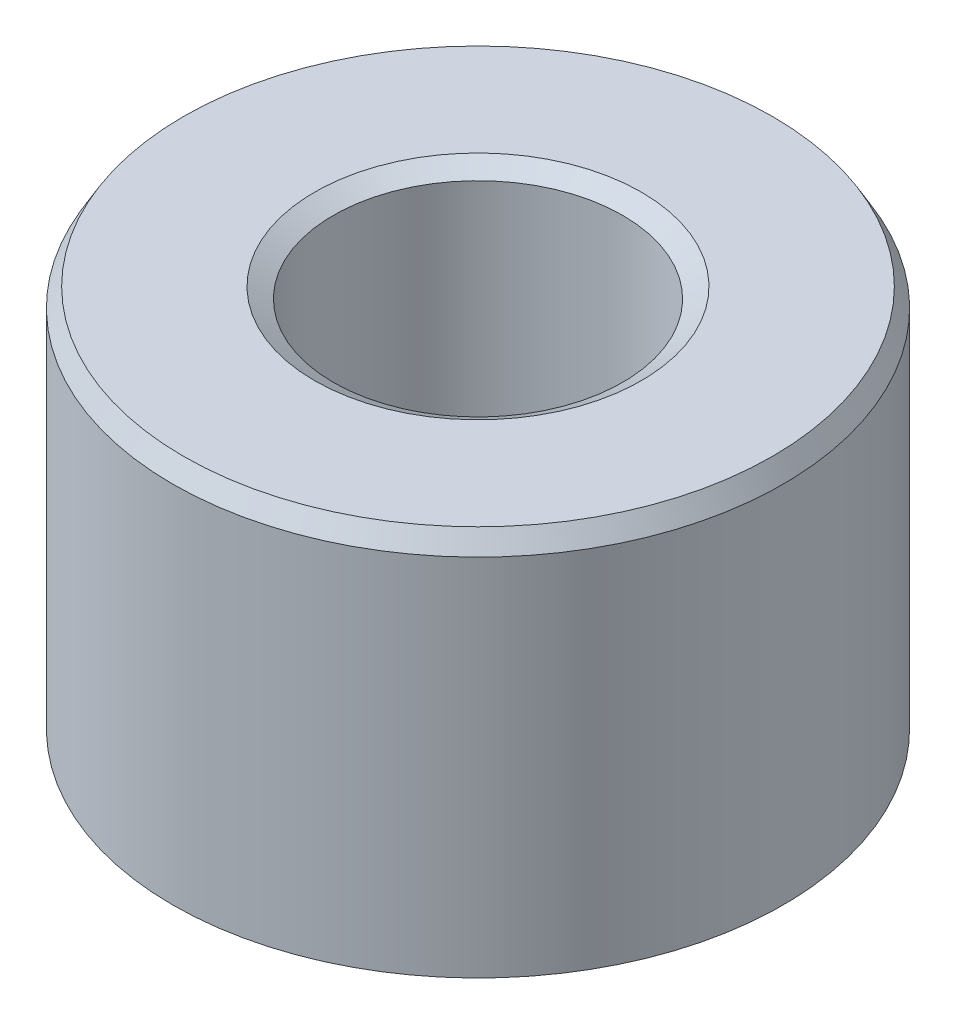
ISO-10303-21;
HEADER;
FILE_DESCRIPTION(('STEP AP214'),'2;1');
FILE_NAME('part.step','',(''),(''),'','','');
FILE_SCHEMA(('AUTOMOTIVE_DESIGN { 1 0 10303 214 1 1 1 1 }'));
ENDSEC;
DATA;
#1=APPLICATION_CONTEXT('core data for automotive mechanical design processes');
#2=APPLICATION_PROTOCOL_DEFINITION('international standard','automotive_design',2000,#1);
#3=PRODUCT_CONTEXT('',#1,'mechanical');
#4=PRODUCT('Part','Part','',(#3));
#5=PRODUCT_RELATED_PRODUCT_CATEGORY('part','',(#4));
#6=PRODUCT_DEFINITION_FORMATION('','',#4);
#7=PRODUCT_DEFINITION_CONTEXT('part definition',#1,'design');
#8=PRODUCT_DEFINITION('design','',#6,#7);
#9=PRODUCT_DEFINITION_SHAPE('','',#8);
#10=(LENGTH_UNIT() NAMED_UNIT(*) SI_UNIT(.MILLI.,.METRE.));
#11=(NAMED_UNIT(*) PLANE_ANGLE_UNIT() SI_UNIT($,.RADIAN.));
#12=(NAMED_UNIT(*) SI_UNIT($,.STERADIAN.) SOLID_ANGLE_UNIT());
#13=UNCERTAINTY_MEASURE_WITH_UNIT(LENGTH_MEASURE(1.E-05),#10,'distance_accuracy_value','');
#14=(GEOMETRIC_REPRESENTATION_CONTEXT(3) GLOBAL_UNCERTAINTY_ASSIGNED_CONTEXT((#13)) GLOBAL_UNIT_ASSIGNED_CONTEXT((#10,
#11,#12)) REPRESENTATION_CONTEXT('',''));
#15=CARTESIAN_POINT('',(0.,0.,0.));
#16=DIRECTION('',(0.,0.,1.));
#17=DIRECTION('',(1.,0.,0.));
#18=AXIS2_PLACEMENT_3D('',#15,#16,#17);
#19=CARTESIAN_POINT('',(0.,58.083758599964,0.));
#20=DIRECTION('',(0.,-1.,0.));
#21=DIRECTION('',(0.,0.,-1.));
#22=AXIS2_PLACEMENT_3D('',#19,#20,#21);
#23=CYLINDRICAL_SURFACE('',#22,45.);
#24=CARTESIAN_POINT('',(0.,1.58924130229331,0.));
#25=DIRECTION('',(0.,1.,0.));
#26=DIRECTION('',(0.,0.,1.));
#27=AXIS2_PLACEMENT_3D('',#24,#25,#26);
#28=CIRCLE('',#27,45.);
#29=CARTESIAN_POINT('',(0.,1.58924130229331,-45.));
#30=VERTEX_POINT('',#29);
#31=EDGE_CURVE('E10',#30,#30,#28,.T.);
#32=CARTESIAN_POINT('',(0.,55.3311119189051,0.));
#33=DIRECTION('',(0.,1.,0.));
#34=DIRECTION('',(0.,0.,1.));
#35=AXIS2_PLACEMENT_3D('',#32,#33,#34);
#36=CIRCLE('',#35,45.);
#37=CARTESIAN_POINT('',(0.,55.3311119189051,-45.));
#38=VERTEX_POINT('',#37);
#39=EDGE_CURVE('E50',#38,#38,#36,.F.);
#40=CARTESIAN_POINT('',(0.,1.58924130229331,-45.));
#41=CARTESIAN_POINT('',(0.,2.14905245454968,-45.));
#42=CARTESIAN_POINT('',(0.,2.70886360680605,-45.));
#43=CARTESIAN_POINT('',(0.,3.8284859113188,-45.));
#44=CARTESIAN_POINT('',(0.,4.38829706357517,-45.));
#45=CARTESIAN_POINT('',(0.,5.50791936808792,-45.));
#46=CARTESIAN_POINT('',(0.,6.06773052034429,-45.));
#47=CARTESIAN_POINT('',(0.,7.18735282485703,-45.));
#48=CARTESIAN_POINT('',(0.,7.74716397711341,-45.));
#49=CARTESIAN_POINT('',(0.,8.86678628162615,-45.));
#50=CARTESIAN_POINT('',(0.,9.42659743388253,-45.));
#51=CARTESIAN_POINT('',(0.,10.5462197383953,-45.));
#52=CARTESIAN_POINT('',(0.,11.1060308906516,-45.));
#53=CARTESIAN_POINT('',(0.,12.2256531951644,-45.));
#54=CARTESIAN_POINT('',(0.,12.7854643474208,-45.));
#55=CARTESIAN_POINT('',(0.,13.9050866519335,-45.));
#56=CARTESIAN_POINT('',(0.,14.4648978041899,-45.));
#57=CARTESIAN_POINT('',(0.,15.5845201087026,-45.));
#58=CARTESIAN_POINT('',(0.,16.144331260959,-45.));
#59=CARTESIAN_POINT('',(0.,17.2639535654717,-45.));
#60=CARTESIAN_POINT('',(0.,17.8237647177281,-45.));
#61=CARTESIAN_POINT('',(0.,18.9433870222409,-45.));
#62=CARTESIAN_POINT('',(0.,19.5031981744972,-45.));
#63=CARTESIAN_POINT('',(0.,20.62282047901,-45.));
#64=CARTESIAN_POINT('',(0.,21.1826316312664,-45.));
#65=CARTESIAN_POINT('',(0.,22.3022539357791,-45.));
#66=CARTESIAN_POINT('',(0.,22.8620650880355,-45.));
#67=CARTESIAN_POINT('',(0.,23.9816873925482,-45.));
#68=CARTESIAN_POINT('',(0.,24.5414985448046,-45.));
#69=CARTESIAN_POINT('',(0.,25.6611208493173,-45.));
#70=CARTESIAN_POINT('',(0.,26.2209320015737,-45.));
#71=CARTESIAN_POINT('',(0.,27.3405543060865,-45.));
#72=CARTESIAN_POINT('',(0.,27.9003654583428,-45.));
#73=CARTESIAN_POINT('',(0.,29.0199877628556,-45.));
#74=CARTESIAN_POINT('',(0.,29.5797989151119,-45.));
#75=CARTESIAN_POINT('',(0.,30.6994212196247,-45.));
#76=CARTESIAN_POINT('',(0.,31.2592323718811,-45.));
#77=CARTESIAN_POINT('',(0.,32.3788546763938,-45.));
#78=CARTESIAN_POINT('',(0.,32.9386658286502,-45.));
#79=CARTESIAN_POINT('',(0.,34.0582881331629,-45.));
#80=CARTESIAN_POINT('',(0.,34.6180992854193,-45.));
#81=CARTESIAN_POINT('',(0.,35.7377215899321,-45.));
#82=CARTESIAN_POINT('',(0.,36.2975327421884,-45.));
#83=CARTESIAN_POINT('',(0.,37.4171550467012,-45.));
#84=CARTESIAN_POINT('',(0.,37.9769661989575,-45.));
#85=CARTESIAN_POINT('',(0.,39.0965885034703,-45.));
#86=CARTESIAN_POINT('',(0.,39.6563996557267,-45.));
#87=CARTESIAN_POINT('',(0.,40.7760219602394,-45.));
#88=CARTESIAN_POINT('',(0.,41.3358331124958,-45.));
#89=CARTESIAN_POINT('',(0.,42.4554554170085,-45.));
#90=CARTESIAN_POINT('',(0.,43.0152665692649,-45.));
#91=CARTESIAN_POINT('',(0.,44.1348888737776,-45.));
#92=CARTESIAN_POINT('',(0.,44.694700026034,-45.));
#93=CARTESIAN_POINT('',(0.,45.8143223305468,-45.));
#94=CARTESIAN_POINT('',(0.,46.3741334828031,-45.));
#95=CARTESIAN_POINT('',(0.,47.4937557873159,-45.));
#96=CARTESIAN_POINT('',(0.,48.0535669395722,-45.));
#97=CARTESIAN_POINT('',(0.,49.173189244085,-45.));
#98=CARTESIAN_POINT('',(0.,49.7330003963414,-45.));
#99=CARTESIAN_POINT('',(0.,50.8526227008541,-45.));
#100=CARTESIAN_POINT('',(0.,51.4124338531105,-45.));
#101=CARTESIAN_POINT('',(0.,52.5320561576232,-45.));
#102=CARTESIAN_POINT('',(0.,53.0918673098796,-45.));
#103=CARTESIAN_POINT('',(0.,54.2114896143924,-45.));
#104=CARTESIAN_POINT('',(0.,54.7713007666487,-45.));
#105=CARTESIAN_POINT('',(0.,55.3311119189051,-45.));
#106=B_SPLINE_CURVE_WITH_KNOTS('',3,(#40,#41,#42,#43,#44,#45,#46,#47,#48,#49,#50,#51,#52,#53,
#54,#55,#56,#57,#58,#59,#60,#61,#62,#63,#64,#65,#66,#67,#68,#69,#70,#71,#72,#73,#74,#75,#76,#77,
#78,#79,#80,#81,#82,#83,#84,#85,#86,#87,#88,#89,#90,#91,#92,#93,#94,#95,#96,#97,#98,#99,#100,
#101,#102,#103,#104,#105),.UNSPECIFIED.,.F.,.F.,(4,2,2,2,2,2,2,2,2,2,2,2,2,2,2,2,2,2,2,2,2,2,2,
2,2,2,2,2,2,2,2,2,4),(0.,1.67943345676912,3.35886691353824,5.03830037030736,6.71773382707647,
8.3971672838456,10.0766007406147,11.7560341973838,13.4354676541529,15.1149011109221,
16.7943345676912,18.4737680244603,20.1532014812294,21.8326349379985,23.5120683947677,
25.1915018515368,26.8709353083059,28.550368765075,30.2298022218441,31.9092356786133,
33.5886691353824,35.2681025921515,36.9475360489206,38.6269695056897,40.3064029624589,
41.985836419228,43.6652698759971,45.3447033327662,47.0241367895353,48.7035702463044,
50.3830037030736,52.0624371598427,53.7418706166118),.UNSPECIFIED.);
#107=EDGE_CURVE('BSEAM39',#30,#38,#106,.T.);
#108=ORIENTED_EDGE('',*,*,#31,.T.);
#109=ORIENTED_EDGE('',*,*,#39,.T.);
#110=ORIENTED_EDGE('',*,*,#107,.T.);
#111=ORIENTED_EDGE('',*,*,#107,.F.);
#112=EDGE_LOOP('',(#108,#110,#109,#111));
#113=FACE_BOUND('',#112,.T.);
#114=ADVANCED_FACE('F39',(#113),#23,.T.);
#115=CARTESIAN_POINT('',(0.,58.083758599964,0.));
#116=DIRECTION('',(0.,1.,0.));
#117=DIRECTION('',(0.,0.,1.));
#118=AXIS2_PLACEMENT_3D('',#115,#116,#117);
#119=PLANE('',#118);
#120=CARTESIAN_POINT('',(0.,58.083758599964,0.));
#121=DIRECTION('',(0.,1.,0.));
#122=DIRECTION('',(0.,0.,1.));
#123=AXIS2_PLACEMENT_3D('',#120,#121,#122);
#124=CIRCLE('',#123,24.0873389880685);
#125=CARTESIAN_POINT('',(0.,58.083758599964,24.0873389880685));
#126=VERTEX_POINT('',#125);
#127=EDGE_CURVE('E58',#126,#126,#124,.F.);
#128=ORIENTED_EDGE('',*,*,#127,.T.);
#129=EDGE_LOOP('',(#128));
#130=FACE_BOUND('',#129,.T.);
#131=CARTESIAN_POINT('',(0.,58.083758599964,0.));
#132=DIRECTION('',(0.,1.,0.));
#133=DIRECTION('',(0.,0.,1.));
#134=AXIS2_PLACEMENT_3D('',#131,#132,#133);
#135=CIRCLE('',#134,43.4107586977067);
#136=CARTESIAN_POINT('',(0.,58.083758599964,43.4107586977067));
#137=VERTEX_POINT('',#136);
#138=EDGE_CURVE('E61',#137,#137,#135,.T.);
#139=ORIENTED_EDGE('',*,*,#138,.T.);
#140=EDGE_LOOP('',(#139));
#141=FACE_BOUND('',#140,.T.);
#142=ADVANCED_FACE('F88',(#130,#141),#119,.T.);
#143=CARTESIAN_POINT('',(0.,0.,0.));
#144=DIRECTION('',(0.,1.,0.));
#145=DIRECTION('',(0.,0.,1.));
#146=AXIS2_PLACEMENT_3D('',#143,#144,#145);
#147=PLANE('',#146);
#148=CARTESIAN_POINT('',(0.,0.,0.));
#149=DIRECTION('',(0.,1.,0.));
#150=DIRECTION('',(0.,0.,1.));
#151=AXIS2_PLACEMENT_3D('',#148,#149,#150);
#152=CIRCLE('',#151,22.9239336093028);
#153=CARTESIAN_POINT('',(0.,0.,22.9239336093028));
#154=VERTEX_POINT('',#153);
#155=EDGE_CURVE('E51',#154,#154,#152,.T.);
#156=ORIENTED_EDGE('',*,*,#155,.T.);
#157=EDGE_LOOP('',(#156));
#158=FACE_BOUND('',#157,.T.);
#159=CARTESIAN_POINT('',(0.,0.,0.));
#160=DIRECTION('',(0.,1.,0.));
#161=DIRECTION('',(0.,0.,1.));
#162=AXIS2_PLACEMENT_3D('',#159,#160,#161);
#163=CIRCLE('',#162,42.247353318941);
#164=CARTESIAN_POINT('',(0.,0.,42.247353318941));
#165=VERTEX_POINT('',#164);
#166=EDGE_CURVE('E54',#165,#165,#163,.F.);
#167=ORIENTED_EDGE('',*,*,#166,.T.);
#168=EDGE_LOOP('',(#167));
#169=FACE_BOUND('',#168,.T.);
#170=ADVANCED_FACE('F83',(#158,#169),#147,.F.);
#171=CARTESIAN_POINT('',(0.,58.083758599964,0.));
#172=DIRECTION('',(0.,-1.,0.));
#173=DIRECTION('',(0.,0.,-1.));
#174=AXIS2_PLACEMENT_3D('',#171,#172,#173);
#175=CYLINDRICAL_SURFACE('',#174,21.3346923070095);
#176=CARTESIAN_POINT('',(0.,56.4945172976707,0.));
#177=DIRECTION('',(0.,1.,0.));
#178=DIRECTION('',(0.,0.,1.));
#179=AXIS2_PLACEMENT_3D('',#176,#177,#178);
#180=CIRCLE('',#179,21.3346923070095);
#181=CARTESIAN_POINT('',(0.,56.4945172976707,-21.3346923070095));
#182=VERTEX_POINT('',#181);
#183=EDGE_CURVE('E67',#182,#182,#180,.T.);
#184=CARTESIAN_POINT('',(0.,2.75264668105887,0.));
#185=DIRECTION('',(0.,1.,0.));
#186=DIRECTION('',(0.,0.,1.));
#187=AXIS2_PLACEMENT_3D('',#184,#185,#186);
#188=CIRCLE('',#187,21.3346923070095);
#189=CARTESIAN_POINT('',(0.,2.75264668105887,-21.3346923070095));
#190=VERTEX_POINT('',#189);
#191=EDGE_CURVE('E69',#190,#190,#188,.F.);
#192=CARTESIAN_POINT('',(0.,56.4945172976707,-21.3346923070095));
#193=CARTESIAN_POINT('',(0.,55.9347061454143,-21.3346923070095));
#194=CARTESIAN_POINT('',(0.,55.3748949931579,-21.3346923070095));
#195=CARTESIAN_POINT('',(0.,54.2552726886452,-21.3346923070095));
#196=CARTESIAN_POINT('',(0.,53.6954615363888,-21.3346923070095));
#197=CARTESIAN_POINT('',(0.,52.5758392318761,-21.3346923070095));
#198=CARTESIAN_POINT('',(0.,52.0160280796197,-21.3346923070095));
#199=CARTESIAN_POINT('',(0.,50.8964057751069,-21.3346923070095));
#200=CARTESIAN_POINT('',(0.,50.3365946228506,-21.3346923070095));
#201=CARTESIAN_POINT('',(0.,49.2169723183378,-21.3346923070095));
#202=CARTESIAN_POINT('',(0.,48.6571611660815,-21.3346923070095));
#203=CARTESIAN_POINT('',(0.,47.5375388615687,-21.3346923070095));
#204=CARTESIAN_POINT('',(0.,46.9777277093123,-21.3346923070095));
#205=CARTESIAN_POINT('',(0.,45.8581054047996,-21.3346923070095));
#206=CARTESIAN_POINT('',(0.,45.2982942525432,-21.3346923070095));
#207=CARTESIAN_POINT('',(0.,44.1786719480305,-21.3346923070095));
#208=CARTESIAN_POINT('',(0.,43.6188607957741,-21.3346923070095));
#209=CARTESIAN_POINT('',(0.,42.4992384912614,-21.3346923070095));
#210=CARTESIAN_POINT('',(0.,41.939427339005,-21.3346923070095));
#211=CARTESIAN_POINT('',(0.,40.8198050344922,-21.3346923070095));
#212=CARTESIAN_POINT('',(0.,40.2599938822359,-21.3346923070095));
#213=CARTESIAN_POINT('',(0.,39.1403715777231,-21.3346923070095));
#214=CARTESIAN_POINT('',(0.,38.5805604254667,-21.3346923070095));
#215=CARTESIAN_POINT('',(0.,37.460938120954,-21.3346923070095));
#216=CARTESIAN_POINT('',(0.,36.9011269686976,-21.3346923070095));
#217=CARTESIAN_POINT('',(0.,35.7815046641849,-21.3346923070095));
#218=CARTESIAN_POINT('',(0.,35.2216935119285,-21.3346923070095));
#219=CARTESIAN_POINT('',(0.,34.1020712074158,-21.3346923070095));
#220=CARTESIAN_POINT('',(0.,33.5422600551594,-21.3346923070095));
#221=CARTESIAN_POINT('',(0.,32.4226377506466,-21.3346923070095));
#222=CARTESIAN_POINT('',(0.,31.8628265983903,-21.3346923070095));
#223=CARTESIAN_POINT('',(0.,30.7432042938775,-21.3346923070095));
#224=CARTESIAN_POINT('',(0.,30.1833931416211,-21.3346923070095));
#225=CARTESIAN_POINT('',(0.,29.0637708371084,-21.3346923070095));
#226=CARTESIAN_POINT('',(0.,28.503959684852,-21.3346923070095));
#227=CARTESIAN_POINT('',(0.,27.3843373803393,-21.3346923070095));
#228=CARTESIAN_POINT('',(0.,26.8245262280829,-21.3346923070095));
#229=CARTESIAN_POINT('',(0.,25.7049039235702,-21.3346923070095));
#230=CARTESIAN_POINT('',(0.,25.1450927713138,-21.3346923070095));
#231=CARTESIAN_POINT('',(0.,24.025470466801,-21.3346923070095));
#232=CARTESIAN_POINT('',(0.,23.4656593145447,-21.3346923070095));
#233=CARTESIAN_POINT('',(0.,22.3460370100319,-21.3346923070095));
#234=CARTESIAN_POINT('',(0.,21.7862258577756,-21.3346923070095));
#235=CARTESIAN_POINT('',(0.,20.6666035532628,-21.3346923070095));
#236=CARTESIAN_POINT('',(0.,20.1067924010064,-21.3346923070095));
#237=CARTESIAN_POINT('',(0.,18.9871700964937,-21.3346923070095));
#238=CARTESIAN_POINT('',(0.,18.4273589442373,-21.3346923070095));
#239=CARTESIAN_POINT('',(0.,17.3077366397246,-21.3346923070095));
#240=CARTESIAN_POINT('',(0.,16.7479254874682,-21.3346923070095));
#241=CARTESIAN_POINT('',(0.,15.6283031829554,-21.3346923070095));
#242=CARTESIAN_POINT('',(0.,15.0684920306991,-21.3346923070095));
#243=CARTESIAN_POINT('',(0.,13.9488697261863,-21.3346923070095));
#244=CARTESIAN_POINT('',(0.,13.38905857393,-21.3346923070095));
#245=CARTESIAN_POINT('',(0.,12.2694362694172,-21.3346923070095));
#246=CARTESIAN_POINT('',(0.,11.7096251171608,-21.3346923070095));
#247=CARTESIAN_POINT('',(0.,10.5900028126481,-21.3346923070095));
#248=CARTESIAN_POINT('',(0.,10.0301916603917,-21.3346923070095));
#249=CARTESIAN_POINT('',(0.,8.91056935587898,-21.3346923070095));
#250=CARTESIAN_POINT('',(0.,8.3507582036226,-21.3346923070095));
#251=CARTESIAN_POINT('',(0.,7.23113589910985,-21.3346923070095));
#252=CARTESIAN_POINT('',(0.,6.67132474685348,-21.3346923070095));
#253=CARTESIAN_POINT('',(0.,5.55170244234073,-21.3346923070095));
#254=CARTESIAN_POINT('',(0.,4.99189129008436,-21.3346923070095));
#255=CARTESIAN_POINT('',(0.,3.87226898557162,-21.3346923070095));
#256=CARTESIAN_POINT('',(0.,3.31245783331525,-21.3346923070095));
#257=CARTESIAN_POINT('',(0.,2.75264668105887,-21.3346923070095));
#258=B_SPLINE_CURVE_WITH_KNOTS('',3,(#192,#193,#194,#195,#196,#197,#198,#199,#200,#201,#202,
#203,#204,#205,#206,#207,#208,#209,#210,#211,#212,#213,#214,#215,#216,#217,#218,#219,#220,#221,
#222,#223,#224,#225,#226,#227,#228,#229,#230,#231,#232,#233,#234,#235,#236,#237,#238,#239,#240,
#241,#242,#243,#244,#245,#246,#247,#248,#249,#250,#251,#252,#253,#254,#255,#256,#257),
.UNSPECIFIED.,.F.,.F.,(4,2,2,2,2,2,2,2,2,2,2,2,2,2,2,2,2,2,2,2,2,2,2,2,2,2,2,2,2,2,2,2,4),(0.,
1.67943345676912,3.35886691353824,5.03830037030736,6.71773382707648,8.3971672838456,
10.0766007406147,11.7560341973838,13.435467654153,15.1149011109221,16.7943345676912,
18.4737680244603,20.1532014812294,21.8326349379985,23.5120683947677,25.1915018515368,
26.8709353083059,28.550368765075,30.2298022218441,31.9092356786133,33.5886691353824,
35.2681025921515,36.9475360489206,38.6269695056897,40.3064029624589,41.985836419228,
43.6652698759971,45.3447033327662,47.0241367895353,48.7035702463045,50.3830037030736,
52.0624371598427,53.7418706166118),.UNSPECIFIED.);
#259=EDGE_CURVE('BSEAM71',#182,#190,#258,.T.);
#260=ORIENTED_EDGE('',*,*,#183,.T.);
#261=ORIENTED_EDGE('',*,*,#191,.T.);
#262=ORIENTED_EDGE('',*,*,#259,.T.);
#263=ORIENTED_EDGE('',*,*,#259,.F.);
#264=EDGE_LOOP('',(#260,#262,#261,#263));
#265=FACE_BOUND('',#264,.T.);
#266=ADVANCED_FACE('F71',(#265),#175,.F.);
#267=CARTESIAN_POINT('',(0.,56.4945172976707,0.));
#268=DIRECTION('',(0.,1.,0.));
#269=DIRECTION('',(0.,0.,1.));
#270=AXIS2_PLACEMENT_3D('',#267,#268,#269);
#271=CONICAL_SURFACE('',#270,21.3346923070095,1.0471975511966);
#272=ORIENTED_EDGE('',*,*,#127,.F.);
#273=EDGE_LOOP('',(#272));
#274=FACE_BOUND('',#273,.T.);
#275=ORIENTED_EDGE('',*,*,#183,.F.);
#276=EDGE_LOOP('',(#275));
#277=FACE_BOUND('',#276,.T.);
#278=ADVANCED_FACE('F77',(#274,#277),#271,.F.);
#279=CARTESIAN_POINT('',(0.,0.,0.));
#280=DIRECTION('',(0.,-1.,0.));
#281=DIRECTION('',(0.,0.,-1.));
#282=AXIS2_PLACEMENT_3D('',#279,#280,#281);
#283=CONICAL_SURFACE('',#282,22.9239336093028,0.523598775598298);
#284=ORIENTED_EDGE('',*,*,#191,.F.);
#285=EDGE_LOOP('',(#284));
#286=FACE_BOUND('',#285,.T.);
#287=ORIENTED_EDGE('',*,*,#155,.F.);
#288=EDGE_LOOP('',(#287));
#289=FACE_BOUND('',#288,.T.);
#290=ADVANCED_FACE('F73',(#286,#289),#283,.F.);
#291=CARTESIAN_POINT('',(0.,1.58924130229331,0.));
#292=DIRECTION('',(0.,1.,0.));
#293=DIRECTION('',(0.,0.,1.));
#294=AXIS2_PLACEMENT_3D('',#291,#292,#293);
#295=CONICAL_SURFACE('',#294,45.,1.0471975511966);
#296=ORIENTED_EDGE('',*,*,#166,.F.);
#297=EDGE_LOOP('',(#296));
#298=FACE_BOUND('',#297,.T.);
#299=ORIENTED_EDGE('',*,*,#31,.F.);
#300=EDGE_LOOP('',(#299));
#301=FACE_BOUND('',#300,.T.);
#302=ADVANCED_FACE('F76',(#298,#301),#295,.T.);
#303=CARTESIAN_POINT('',(0.,58.083758599964,0.));
#304=DIRECTION('',(0.,-1.,0.));
#305=DIRECTION('',(0.,0.,-1.));
#306=AXIS2_PLACEMENT_3D('',#303,#304,#305);
#307=CONICAL_SURFACE('',#306,43.4107586977067,0.523598775598296);
#308=ORIENTED_EDGE('',*,*,#39,.F.);
#309=EDGE_LOOP('',(#308));
#310=FACE_BOUND('',#309,.T.);
#311=ORIENTED_EDGE('',*,*,#138,.F.);
#312=EDGE_LOOP('',(#311));
#313=FACE_BOUND('',#312,.T.);
#314=ADVANCED_FACE('F45',(#310,#313),#307,.T.);
#315=CLOSED_SHELL('',(#114,#142,#170,#266,#278,#290,#302,#314));
#316=MANIFOLD_SOLID_BREP('B2',#315);
#317=ADVANCED_BREP_SHAPE_REPRESENTATION('',(#18,#316),#14);
#318=SHAPE_DEFINITION_REPRESENTATION(#9,#317);
ENDSEC;
END-ISO-10303-21;
